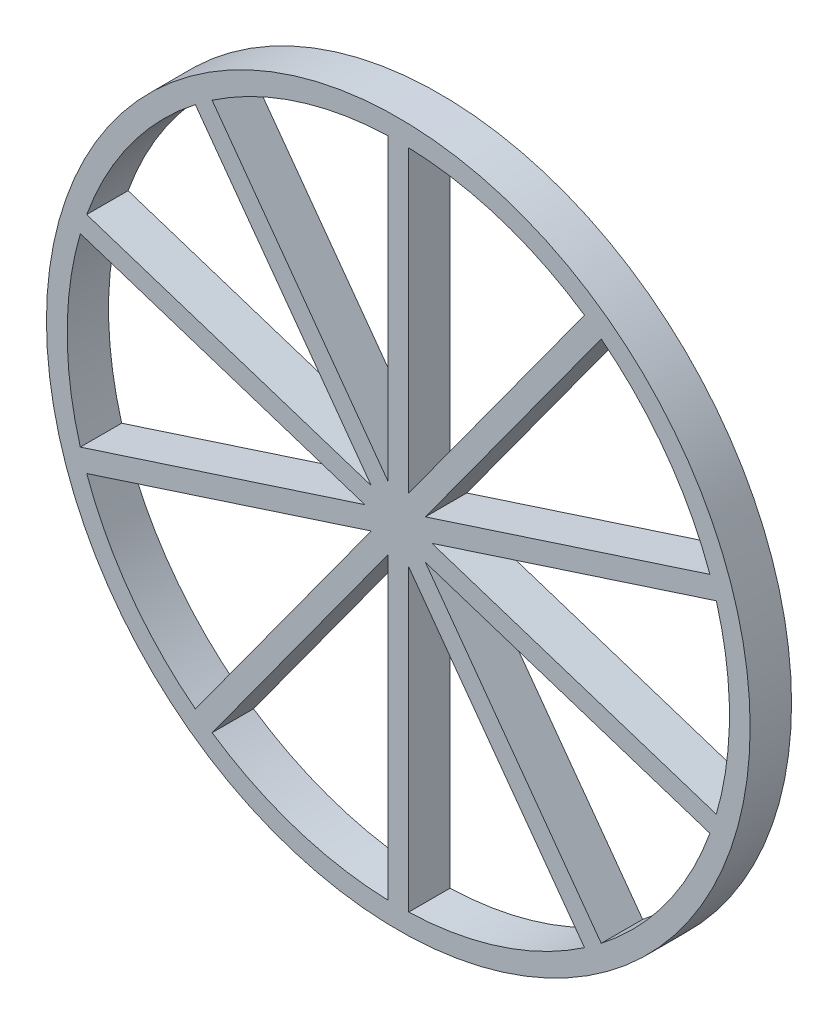
ISO-10303-21;
HEADER;
FILE_DESCRIPTION(('STEP AP214'),'2;1');
FILE_NAME('part.step','',(''),(''),'','','');
FILE_SCHEMA(('AUTOMOTIVE_DESIGN { 1 0 10303 214 1 1 1 1 }'));
ENDSEC;
DATA;
#1=APPLICATION_CONTEXT('core data for automotive mechanical design processes');
#2=APPLICATION_PROTOCOL_DEFINITION('international standard','automotive_design',2000,#1);
#3=PRODUCT_CONTEXT('',#1,'mechanical');
#4=PRODUCT('Part','Part','',(#3));
#5=PRODUCT_RELATED_PRODUCT_CATEGORY('part','',(#4));
#6=PRODUCT_DEFINITION_FORMATION('','',#4);
#7=PRODUCT_DEFINITION_CONTEXT('part definition',#1,'design');
#8=PRODUCT_DEFINITION('design','',#6,#7);
#9=PRODUCT_DEFINITION_SHAPE('','',#8);
#10=(LENGTH_UNIT() NAMED_UNIT(*) SI_UNIT(.MILLI.,.METRE.));
#11=(NAMED_UNIT(*) PLANE_ANGLE_UNIT() SI_UNIT($,.RADIAN.));
#12=(NAMED_UNIT(*) SI_UNIT($,.STERADIAN.) SOLID_ANGLE_UNIT());
#13=UNCERTAINTY_MEASURE_WITH_UNIT(LENGTH_MEASURE(1.E-05),#10,'distance_accuracy_value','');
#14=(GEOMETRIC_REPRESENTATION_CONTEXT(3) GLOBAL_UNCERTAINTY_ASSIGNED_CONTEXT((#13)) GLOBAL_UNIT_ASSIGNED_CONTEXT((#10,
#11,#12)) REPRESENTATION_CONTEXT('',''));
#15=CARTESIAN_POINT('',(0.,0.,0.));
#16=DIRECTION('',(0.,0.,1.));
#17=DIRECTION('',(1.,0.,0.));
#18=AXIS2_PLACEMENT_3D('',#15,#16,#17);
#19=CARTESIAN_POINT('',(0.,0.,1.));
#20=DIRECTION('',(0.,0.,1.));
#21=DIRECTION('',(1.,0.,0.));
#22=AXIS2_PLACEMENT_3D('',#19,#20,#21);
#23=PLANE('',#22);
#24=CARTESIAN_POINT('',(0.,0.,1.));
#25=DIRECTION('',(0.,0.,1.));
#26=DIRECTION('',(1.,0.,0.));
#27=AXIS2_PLACEMENT_3D('',#24,#25,#26);
#28=CIRCLE('',#27,8.5);
#29=CARTESIAN_POINT('',(8.5,0.,1.));
#30=VERTEX_POINT('',#29);
#31=EDGE_CURVE('E11',#30,#30,#28,.T.);
#32=ORIENTED_EDGE('',*,*,#31,.T.);
#33=EDGE_LOOP('',(#32));
#34=FACE_BOUND('',#33,.T.);
#35=DIRECTION('',(0.,-1.,0.));
#36=VECTOR('',#35,1.);
#37=CARTESIAN_POINT('',(0.25,0.769420884293812,1.));
#38=LINE('',#37,#36);
#39=CARTESIAN_POINT('',(0.25,7.99609279585974,1.));
#40=VERTEX_POINT('',#39);
#41=CARTESIAN_POINT('',(0.25,0.769420884293812,1.));
#42=VERTEX_POINT('',#41);
#43=EDGE_CURVE('E451',#40,#42,#38,.T.);
#44=ORIENTED_EDGE('',*,*,#43,.F.);
#45=CARTESIAN_POINT('',(0.,0.,1.));
#46=DIRECTION('',(0.,0.,1.));
#47=DIRECTION('',(1.,0.,0.));
#48=AXIS2_PLACEMENT_3D('',#45,#46,#47);
#49=CIRCLE('',#48,8.);
#50=CARTESIAN_POINT('',(4.49773117277472,6.61592127352273,1.));
#51=VERTEX_POINT('',#50);
#52=EDGE_CURVE('E449',#51,#40,#49,.T.);
#53=ORIENTED_EDGE('',*,*,#52,.F.);
#54=DIRECTION('',(0.587785252292474,0.809016994374947,0.));
#55=VECTOR('',#54,1.);
#56=CARTESIAN_POINT('',(0.25,0.769420884293812,1.));
#57=LINE('',#56,#55);
#58=EDGE_CURVE('E455',#42,#51,#57,.T.);
#59=ORIENTED_EDGE('',*,*,#58,.F.);
#60=EDGE_LOOP('',(#44,#53,#59));
#61=FACE_BOUND('',#60,.T.);
#62=DIRECTION('',(0.587785252292462,-0.809016994374955,0.));
#63=VECTOR('',#62,1.);
#64=CARTESIAN_POINT('',(-0.25,0.769420884293831,1.));
#65=LINE('',#64,#63);
#66=CARTESIAN_POINT('',(-4.49773117277462,6.61592127352279,1.));
#67=VERTEX_POINT('',#66);
#68=CARTESIAN_POINT('',(-0.25,0.769420884293831,1.));
#69=VERTEX_POINT('',#68);
#70=EDGE_CURVE('E427',#67,#69,#65,.T.);
#71=ORIENTED_EDGE('',*,*,#70,.F.);
#72=CARTESIAN_POINT('',(0.,0.,1.));
#73=DIRECTION('',(0.,0.,1.));
#74=DIRECTION('',(1.,0.,0.));
#75=AXIS2_PLACEMENT_3D('',#72,#73,#74);
#76=CIRCLE('',#75,8.);
#77=CARTESIAN_POINT('',(-0.25,7.99609279585974,1.));
#78=VERTEX_POINT('',#77);
#79=EDGE_CURVE('E425',#78,#67,#76,.T.);
#80=ORIENTED_EDGE('',*,*,#79,.F.);
#81=DIRECTION('',(0.,1.,0.));
#82=VECTOR('',#81,1.);
#83=CARTESIAN_POINT('',(-0.25,0.769420884293831,1.));
#84=LINE('',#83,#82);
#85=EDGE_CURVE('E431',#69,#78,#84,.T.);
#86=ORIENTED_EDGE('',*,*,#85,.F.);
#87=EDGE_LOOP('',(#71,#80,#86));
#88=FACE_BOUND('',#87,.T.);
#89=DIRECTION('',(0.,-1.,0.));
#90=VECTOR('',#89,1.);
#91=CARTESIAN_POINT('',(0.249999999999995,-0.769420884293813,1.));
#92=LINE('',#91,#90);
#93=CARTESIAN_POINT('',(0.249999999999995,-0.769420884293813,1.));
#94=VERTEX_POINT('',#93);
#95=CARTESIAN_POINT('',(0.249999999999944,-7.99609279585974,1.));
#96=VERTEX_POINT('',#95);
#97=EDGE_CURVE('E403',#94,#96,#92,.T.);
#98=ORIENTED_EDGE('',*,*,#97,.F.);
#99=DIRECTION('',(-0.587785252292468,0.809016994374951,0.));
#100=VECTOR('',#99,1.);
#101=CARTESIAN_POINT('',(0.249999999999995,-0.769420884293813,1.));
#102=LINE('',#101,#100);
#103=CARTESIAN_POINT('',(4.49773117277467,-6.61592127352276,1.));
#104=VERTEX_POINT('',#103);
#105=EDGE_CURVE('E401',#104,#94,#102,.T.);
#106=ORIENTED_EDGE('',*,*,#105,.F.);
#107=CARTESIAN_POINT('',(0.,0.,1.));
#108=DIRECTION('',(0.,0.,1.));
#109=DIRECTION('',(1.,0.,0.));
#110=AXIS2_PLACEMENT_3D('',#107,#108,#109);
#111=CIRCLE('',#110,8.);
#112=EDGE_CURVE('E407',#96,#104,#111,.T.);
#113=ORIENTED_EDGE('',*,*,#112,.F.);
#114=EDGE_LOOP('',(#98,#106,#113));
#115=FACE_BOUND('',#114,.T.);
#116=DIRECTION('',(-0.587785252292462,0.809016994374955,0.));
#117=VECTOR('',#116,1.);
#118=CARTESIAN_POINT('',(-0.654508497187466,0.475528258147583,1.));
#119=LINE('',#118,#117);
#120=CARTESIAN_POINT('',(-0.654508497187466,0.475528258147583,1.));
#121=VERTEX_POINT('',#120);
#122=CARTESIAN_POINT('',(-4.9022396699621,6.32202864737656,1.));
#123=VERTEX_POINT('',#122);
#124=EDGE_CURVE('E379',#121,#123,#119,.T.);
#125=ORIENTED_EDGE('',*,*,#124,.F.);
#126=DIRECTION('',(0.95105651629515,-0.309016994374958,0.));
#127=VECTOR('',#126,1.);
#128=CARTESIAN_POINT('',(-0.654508497187466,0.475528258147583,1.));
#129=LINE('',#128,#127);
#130=CARTESIAN_POINT('',(-7.52748190980937,2.70869269159362,1.));
#131=VERTEX_POINT('',#130);
#132=EDGE_CURVE('E377',#131,#121,#129,.T.);
#133=ORIENTED_EDGE('',*,*,#132,.F.);
#134=CARTESIAN_POINT('',(0.,0.,1.));
#135=DIRECTION('',(0.,0.,1.));
#136=DIRECTION('',(1.,0.,0.));
#137=AXIS2_PLACEMENT_3D('',#134,#135,#136);
#138=CIRCLE('',#137,8.);
#139=EDGE_CURVE('E383',#123,#131,#138,.T.);
#140=ORIENTED_EDGE('',*,*,#139,.F.);
#141=EDGE_LOOP('',(#125,#133,#140));
#142=FACE_BOUND('',#141,.T.);
#143=DIRECTION('',(-0.587785252292474,-0.809016994374947,0.));
#144=VECTOR('',#143,1.);
#145=CARTESIAN_POINT('',(0.654508497187473,0.475528258147574,1.));
#146=LINE('',#145,#144);
#147=CARTESIAN_POINT('',(4.90223966996219,6.32202864737649,1.));
#148=VERTEX_POINT('',#147);
#149=CARTESIAN_POINT('',(0.654508497187473,0.475528258147574,1.));
#150=VERTEX_POINT('',#149);
#151=EDGE_CURVE('E355',#148,#150,#146,.T.);
#152=ORIENTED_EDGE('',*,*,#151,.F.);
#153=CARTESIAN_POINT('',(0.,0.,1.));
#154=DIRECTION('',(0.,0.,1.));
#155=DIRECTION('',(1.,0.,0.));
#156=AXIS2_PLACEMENT_3D('',#153,#154,#155);
#157=CIRCLE('',#156,8.);
#158=CARTESIAN_POINT('',(7.52748190980941,2.70869269159351,1.));
#159=VERTEX_POINT('',#158);
#160=EDGE_CURVE('E353',#159,#148,#157,.T.);
#161=ORIENTED_EDGE('',*,*,#160,.F.);
#162=DIRECTION('',(0.951056516295154,0.309016994374945,0.));
#163=VECTOR('',#162,1.);
#164=CARTESIAN_POINT('',(0.654508497187473,0.475528258147574,1.));
#165=LINE('',#164,#163);
#166=EDGE_CURVE('E359',#150,#159,#165,.T.);
#167=ORIENTED_EDGE('',*,*,#166,.F.);
#168=EDGE_LOOP('',(#152,#161,#167));
#169=FACE_BOUND('',#168,.T.);
#170=DIRECTION('',(-0.951056516295154,-0.309016994374945,0.));
#171=VECTOR('',#170,1.);
#172=CARTESIAN_POINT('',(0.809016994374946,0.,1.));
#173=LINE('',#172,#171);
#174=CARTESIAN_POINT('',(7.68199040699688,2.23316443344594,1.));
#175=VERTEX_POINT('',#174);
#176=CARTESIAN_POINT('',(0.809016994374946,0.,1.));
#177=VERTEX_POINT('',#176);
#178=EDGE_CURVE('E331',#175,#177,#173,.T.);
#179=ORIENTED_EDGE('',*,*,#178,.F.);
#180=CARTESIAN_POINT('',(0.,0.,1.));
#181=DIRECTION('',(0.,0.,1.));
#182=DIRECTION('',(1.,0.,0.));
#183=AXIS2_PLACEMENT_3D('',#180,#181,#182);
#184=CIRCLE('',#183,8.);
#185=CARTESIAN_POINT('',(7.68199040699687,-2.23316443344599,1.));
#186=VERTEX_POINT('',#185);
#187=EDGE_CURVE('E329',#186,#175,#184,.T.);
#188=ORIENTED_EDGE('',*,*,#187,.F.);
#189=DIRECTION('',(0.951056516295152,-0.309016994374952,0.));
#190=VECTOR('',#189,1.);
#191=CARTESIAN_POINT('',(0.809016994374946,0.,1.));
#192=LINE('',#191,#190);
#193=EDGE_CURVE('E335',#177,#186,#192,.T.);
#194=ORIENTED_EDGE('',*,*,#193,.F.);
#195=EDGE_LOOP('',(#179,#188,#194));
#196=FACE_BOUND('',#195,.T.);
#197=DIRECTION('',(-0.951056516295152,0.309016994374952,0.));
#198=VECTOR('',#197,1.);
#199=CARTESIAN_POINT('',(0.65450849718747,-0.475528258147579,1.));
#200=LINE('',#199,#198);
#201=CARTESIAN_POINT('',(7.52748190980939,-2.70869269159357,1.));
#202=VERTEX_POINT('',#201);
#203=CARTESIAN_POINT('',(0.65450849718747,-0.475528258147579,1.));
#204=VERTEX_POINT('',#203);
#205=EDGE_CURVE('E307',#202,#204,#200,.T.);
#206=ORIENTED_EDGE('',*,*,#205,.F.);
#207=CARTESIAN_POINT('',(0.,0.,1.));
#208=DIRECTION('',(0.,0.,1.));
#209=DIRECTION('',(1.,0.,0.));
#210=AXIS2_PLACEMENT_3D('',#207,#208,#209);
#211=CIRCLE('',#210,8.);
#212=CARTESIAN_POINT('',(4.90223966996214,-6.32202864737652,1.));
#213=VERTEX_POINT('',#212);
#214=EDGE_CURVE('E305',#213,#202,#211,.T.);
#215=ORIENTED_EDGE('',*,*,#214,.F.);
#216=DIRECTION('',(0.587785252292468,-0.809016994374951,0.));
#217=VECTOR('',#216,1.);
#218=CARTESIAN_POINT('',(0.65450849718747,-0.475528258147579,1.));
#219=LINE('',#218,#217);
#220=EDGE_CURVE('E311',#204,#213,#219,.T.);
#221=ORIENTED_EDGE('',*,*,#220,.F.);
#222=EDGE_LOOP('',(#206,#215,#221));
#223=FACE_BOUND('',#222,.T.);
#224=DIRECTION('',(0.,1.,0.));
#225=VECTOR('',#224,1.);
#226=CARTESIAN_POINT('',(-0.250000000000005,-0.769420884293809,1.));
#227=LINE('',#226,#225);
#228=CARTESIAN_POINT('',(-0.250000000000056,-7.99609279585974,1.));
#229=VERTEX_POINT('',#228);
#230=CARTESIAN_POINT('',(-0.250000000000005,-0.769420884293809,1.));
#231=VERTEX_POINT('',#230);
#232=EDGE_CURVE('E283',#229,#231,#227,.T.);
#233=ORIENTED_EDGE('',*,*,#232,.F.);
#234=CARTESIAN_POINT('',(0.,0.,1.));
#235=DIRECTION('',(0.,0.,1.));
#236=DIRECTION('',(1.,0.,0.));
#237=AXIS2_PLACEMENT_3D('',#234,#235,#236);
#238=CIRCLE('',#237,8.);
#239=CARTESIAN_POINT('',(-4.49773117277476,-6.61592127352269,1.));
#240=VERTEX_POINT('',#239);
#241=EDGE_CURVE('E281',#240,#229,#238,.T.);
#242=ORIENTED_EDGE('',*,*,#241,.F.);
#243=DIRECTION('',(-0.58778525229248,-0.809016994374942,0.));
#244=VECTOR('',#243,1.);
#245=CARTESIAN_POINT('',(-0.250000000000005,-0.769420884293809,1.));
#246=LINE('',#245,#244);
#247=EDGE_CURVE('E287',#231,#240,#246,.T.);
#248=ORIENTED_EDGE('',*,*,#247,.F.);
#249=EDGE_LOOP('',(#233,#242,#248));
#250=FACE_BOUND('',#249,.T.);
#251=DIRECTION('',(0.58778525229248,0.809016994374942,0.));
#252=VECTOR('',#251,1.);
#253=CARTESIAN_POINT('',(-0.654508497187477,-0.47552825814757,1.));
#254=LINE('',#253,#252);
#255=CARTESIAN_POINT('',(-4.90223966996223,-6.32202864737645,1.));
#256=VERTEX_POINT('',#255);
#257=CARTESIAN_POINT('',(-0.654508497187477,-0.47552825814757,1.));
#258=VERTEX_POINT('',#257);
#259=EDGE_CURVE('E259',#256,#258,#254,.T.);
#260=ORIENTED_EDGE('',*,*,#259,.F.);
#261=CARTESIAN_POINT('',(0.,0.,1.));
#262=DIRECTION('',(0.,0.,1.));
#263=DIRECTION('',(1.,0.,0.));
#264=AXIS2_PLACEMENT_3D('',#261,#262,#263);
#265=CIRCLE('',#264,8.);
#266=CARTESIAN_POINT('',(-7.52748190980943,-2.70869269159346,1.));
#267=VERTEX_POINT('',#266);
#268=EDGE_CURVE('E257',#267,#256,#265,.T.);
#269=ORIENTED_EDGE('',*,*,#268,.F.);
#270=DIRECTION('',(-0.951056516295157,-0.309016994374938,0.));
#271=VECTOR('',#270,1.);
#272=CARTESIAN_POINT('',(-0.654508497187477,-0.47552825814757,1.));
#273=LINE('',#272,#271);
#274=EDGE_CURVE('E263',#258,#267,#273,.T.);
#275=ORIENTED_EDGE('',*,*,#274,.F.);
#276=EDGE_LOOP('',(#260,#269,#275));
#277=FACE_BOUND('',#276,.T.);
#278=DIRECTION('',(0.951056516295156,0.309016994374938,0.));
#279=VECTOR('',#278,1.);
#280=CARTESIAN_POINT('',(-0.809016994374945,0.,1.));
#281=LINE('',#280,#279);
#282=CARTESIAN_POINT('',(-7.68199040699689,-2.23316443344588,1.));
#283=VERTEX_POINT('',#282);
#284=CARTESIAN_POINT('',(-0.809016994374945,0.,1.));
#285=VERTEX_POINT('',#284);
#286=EDGE_CURVE('E238',#283,#285,#281,.T.);
#287=ORIENTED_EDGE('',*,*,#286,.F.);
#288=CARTESIAN_POINT('',(0.,0.,1.));
#289=DIRECTION('',(0.,0.,1.));
#290=DIRECTION('',(1.,0.,0.));
#291=AXIS2_PLACEMENT_3D('',#288,#289,#290);
#292=CIRCLE('',#291,8.);
#293=CARTESIAN_POINT('',(-7.68199040699685,2.23316443344604,1.));
#294=VERTEX_POINT('',#293);
#295=EDGE_CURVE('E230',#294,#283,#292,.T.);
#296=ORIENTED_EDGE('',*,*,#295,.F.);
#297=DIRECTION('',(-0.95105651629515,0.309016994374958,0.));
#298=VECTOR('',#297,1.);
#299=CARTESIAN_POINT('',(-0.809016994374945,0.,1.));
#300=LINE('',#299,#298);
#301=EDGE_CURVE('E247',#285,#294,#300,.T.);
#302=ORIENTED_EDGE('',*,*,#301,.F.);
#303=EDGE_LOOP('',(#287,#296,#302));
#304=FACE_BOUND('',#303,.T.);
#305=ADVANCED_FACE('F33',(#34,#61,#88,#115,#142,#169,#196,#223,#250,#277,#304),#23,.T.);
#306=CARTESIAN_POINT('',(0.,0.,0.));
#307=DIRECTION('',(0.,0.,1.));
#308=DIRECTION('',(1.,0.,0.));
#309=AXIS2_PLACEMENT_3D('',#306,#307,#308);
#310=PLANE('',#309);
#311=CARTESIAN_POINT('',(0.,0.,0.));
#312=DIRECTION('',(0.,0.,1.));
#313=DIRECTION('',(1.,0.,0.));
#314=AXIS2_PLACEMENT_3D('',#311,#312,#313);
#315=CIRCLE('',#314,8.);
#316=CARTESIAN_POINT('',(-7.52748190980943,-2.70869269159346,0.));
#317=VERTEX_POINT('',#316);
#318=CARTESIAN_POINT('',(-4.90223966996223,-6.32202864737645,0.));
#319=VERTEX_POINT('',#318);
#320=EDGE_CURVE('E245',#317,#319,#315,.T.);
#321=ORIENTED_EDGE('',*,*,#320,.T.);
#322=DIRECTION('',(0.58778525229248,0.809016994374942,0.));
#323=VECTOR('',#322,1.);
#324=CARTESIAN_POINT('',(-0.654508497187477,-0.47552825814757,0.));
#325=LINE('',#324,#323);
#326=CARTESIAN_POINT('',(-0.654508497187477,-0.47552825814757,0.));
#327=VERTEX_POINT('',#326);
#328=EDGE_CURVE('E268',#319,#327,#325,.T.);
#329=ORIENTED_EDGE('',*,*,#328,.T.);
#330=DIRECTION('',(-0.951056516295157,-0.309016994374938,0.));
#331=VECTOR('',#330,1.);
#332=CARTESIAN_POINT('',(-0.654508497187477,-0.47552825814757,0.));
#333=LINE('',#332,#331);
#334=EDGE_CURVE('E260',#327,#317,#333,.T.);
#335=ORIENTED_EDGE('',*,*,#334,.T.);
#336=EDGE_LOOP('',(#321,#329,#335));
#337=FACE_BOUND('',#336,.T.);
#338=CARTESIAN_POINT('',(0.,0.,0.));
#339=DIRECTION('',(0.,0.,1.));
#340=DIRECTION('',(1.,0.,0.));
#341=AXIS2_PLACEMENT_3D('',#338,#339,#340);
#342=CIRCLE('',#341,8.);
#343=CARTESIAN_POINT('',(4.90223966996214,-6.32202864737652,0.));
#344=VERTEX_POINT('',#343);
#345=CARTESIAN_POINT('',(7.52748190980939,-2.70869269159357,0.));
#346=VERTEX_POINT('',#345);
#347=EDGE_CURVE('E304',#344,#346,#342,.T.);
#348=ORIENTED_EDGE('',*,*,#347,.T.);
#349=DIRECTION('',(-0.951056516295152,0.309016994374952,0.));
#350=VECTOR('',#349,1.);
#351=CARTESIAN_POINT('',(0.65450849718747,-0.475528258147579,0.));
#352=LINE('',#351,#350);
#353=CARTESIAN_POINT('',(0.65450849718747,-0.475528258147579,0.));
#354=VERTEX_POINT('',#353);
#355=EDGE_CURVE('E316',#346,#354,#352,.T.);
#356=ORIENTED_EDGE('',*,*,#355,.T.);
#357=DIRECTION('',(0.587785252292468,-0.809016994374951,0.));
#358=VECTOR('',#357,1.);
#359=CARTESIAN_POINT('',(0.65450849718747,-0.475528258147579,0.));
#360=LINE('',#359,#358);
#361=EDGE_CURVE('E308',#354,#344,#360,.T.);
#362=ORIENTED_EDGE('',*,*,#361,.T.);
#363=EDGE_LOOP('',(#348,#356,#362));
#364=FACE_BOUND('',#363,.T.);
#365=CARTESIAN_POINT('',(0.,0.,0.));
#366=DIRECTION('',(0.,0.,1.));
#367=DIRECTION('',(1.,0.,0.));
#368=AXIS2_PLACEMENT_3D('',#365,#366,#367);
#369=CIRCLE('',#368,8.);
#370=CARTESIAN_POINT('',(7.52748190980941,2.70869269159351,0.));
#371=VERTEX_POINT('',#370);
#372=CARTESIAN_POINT('',(4.90223966996219,6.32202864737649,0.));
#373=VERTEX_POINT('',#372);
#374=EDGE_CURVE('E352',#371,#373,#369,.T.);
#375=ORIENTED_EDGE('',*,*,#374,.T.);
#376=DIRECTION('',(-0.587785252292474,-0.809016994374947,0.));
#377=VECTOR('',#376,1.);
#378=CARTESIAN_POINT('',(0.654508497187473,0.475528258147574,0.));
#379=LINE('',#378,#377);
#380=CARTESIAN_POINT('',(0.654508497187473,0.475528258147574,0.));
#381=VERTEX_POINT('',#380);
#382=EDGE_CURVE('E364',#373,#381,#379,.T.);
#383=ORIENTED_EDGE('',*,*,#382,.T.);
#384=DIRECTION('',(0.951056516295154,0.309016994374945,0.));
#385=VECTOR('',#384,1.);
#386=CARTESIAN_POINT('',(0.654508497187473,0.475528258147574,0.));
#387=LINE('',#386,#385);
#388=EDGE_CURVE('E356',#381,#371,#387,.T.);
#389=ORIENTED_EDGE('',*,*,#388,.T.);
#390=EDGE_LOOP('',(#375,#383,#389));
#391=FACE_BOUND('',#390,.T.);
#392=DIRECTION('',(-0.587785252292468,0.809016994374951,0.));
#393=VECTOR('',#392,1.);
#394=CARTESIAN_POINT('',(0.249999999999995,-0.769420884293813,0.));
#395=LINE('',#394,#393);
#396=CARTESIAN_POINT('',(4.49773117277467,-6.61592127352276,0.));
#397=VERTEX_POINT('',#396);
#398=CARTESIAN_POINT('',(0.249999999999995,-0.769420884293813,0.));
#399=VERTEX_POINT('',#398);
#400=EDGE_CURVE('E400',#397,#399,#395,.T.);
#401=ORIENTED_EDGE('',*,*,#400,.T.);
#402=DIRECTION('',(0.,-1.,0.));
#403=VECTOR('',#402,1.);
#404=CARTESIAN_POINT('',(0.249999999999995,-0.769420884293813,0.));
#405=LINE('',#404,#403);
#406=CARTESIAN_POINT('',(0.249999999999944,-7.99609279585974,0.));
#407=VERTEX_POINT('',#406);
#408=EDGE_CURVE('E412',#399,#407,#405,.T.);
#409=ORIENTED_EDGE('',*,*,#408,.T.);
#410=CARTESIAN_POINT('',(0.,0.,0.));
#411=DIRECTION('',(0.,0.,1.));
#412=DIRECTION('',(1.,0.,0.));
#413=AXIS2_PLACEMENT_3D('',#410,#411,#412);
#414=CIRCLE('',#413,8.);
#415=EDGE_CURVE('E404',#407,#397,#414,.T.);
#416=ORIENTED_EDGE('',*,*,#415,.T.);
#417=EDGE_LOOP('',(#401,#409,#416));
#418=FACE_BOUND('',#417,.T.);
#419=CARTESIAN_POINT('',(0.,0.,0.));
#420=DIRECTION('',(0.,0.,1.));
#421=DIRECTION('',(1.,0.,0.));
#422=AXIS2_PLACEMENT_3D('',#419,#420,#421);
#423=CIRCLE('',#422,8.);
#424=CARTESIAN_POINT('',(4.49773117277472,6.61592127352273,0.));
#425=VERTEX_POINT('',#424);
#426=CARTESIAN_POINT('',(0.25,7.99609279585974,0.));
#427=VERTEX_POINT('',#426);
#428=EDGE_CURVE('E448',#425,#427,#423,.T.);
#429=ORIENTED_EDGE('',*,*,#428,.T.);
#430=DIRECTION('',(0.,-1.,0.));
#431=VECTOR('',#430,1.);
#432=CARTESIAN_POINT('',(0.25,0.769420884293812,0.));
#433=LINE('',#432,#431);
#434=CARTESIAN_POINT('',(0.25,0.769420884293812,0.));
#435=VERTEX_POINT('',#434);
#436=EDGE_CURVE('E460',#427,#435,#433,.T.);
#437=ORIENTED_EDGE('',*,*,#436,.T.);
#438=DIRECTION('',(0.587785252292474,0.809016994374947,0.));
#439=VECTOR('',#438,1.);
#440=CARTESIAN_POINT('',(0.25,0.769420884293812,0.));
#441=LINE('',#440,#439);
#442=EDGE_CURVE('E452',#435,#425,#441,.T.);
#443=ORIENTED_EDGE('',*,*,#442,.T.);
#444=EDGE_LOOP('',(#429,#437,#443));
#445=FACE_BOUND('',#444,.T.);
#446=CARTESIAN_POINT('',(0.,0.,0.));
#447=DIRECTION('',(0.,0.,1.));
#448=DIRECTION('',(1.,0.,0.));
#449=AXIS2_PLACEMENT_3D('',#446,#447,#448);
#450=CIRCLE('',#449,8.5);
#451=CARTESIAN_POINT('',(8.5,0.,0.));
#452=VERTEX_POINT('',#451);
#453=EDGE_CURVE('E37',#452,#452,#450,.T.);
#454=ORIENTED_EDGE('',*,*,#453,.F.);
#455=EDGE_LOOP('',(#454));
#456=FACE_BOUND('',#455,.T.);
#457=CARTESIAN_POINT('',(0.,0.,0.));
#458=DIRECTION('',(0.,0.,1.));
#459=DIRECTION('',(1.,0.,0.));
#460=AXIS2_PLACEMENT_3D('',#457,#458,#459);
#461=CIRCLE('',#460,8.);
#462=CARTESIAN_POINT('',(-0.25,7.99609279585974,0.));
#463=VERTEX_POINT('',#462);
#464=CARTESIAN_POINT('',(-4.49773117277462,6.61592127352279,0.));
#465=VERTEX_POINT('',#464);
#466=EDGE_CURVE('E424',#463,#465,#461,.T.);
#467=ORIENTED_EDGE('',*,*,#466,.T.);
#468=DIRECTION('',(0.587785252292462,-0.809016994374955,0.));
#469=VECTOR('',#468,1.);
#470=CARTESIAN_POINT('',(-0.25,0.769420884293831,0.));
#471=LINE('',#470,#469);
#472=CARTESIAN_POINT('',(-0.25,0.769420884293831,0.));
#473=VERTEX_POINT('',#472);
#474=EDGE_CURVE('E436',#465,#473,#471,.T.);
#475=ORIENTED_EDGE('',*,*,#474,.T.);
#476=DIRECTION('',(0.,1.,0.));
#477=VECTOR('',#476,1.);
#478=CARTESIAN_POINT('',(-0.25,0.769420884293831,0.));
#479=LINE('',#478,#477);
#480=EDGE_CURVE('E428',#473,#463,#479,.T.);
#481=ORIENTED_EDGE('',*,*,#480,.T.);
#482=EDGE_LOOP('',(#467,#475,#481));
#483=FACE_BOUND('',#482,.T.);
#484=DIRECTION('',(0.95105651629515,-0.309016994374958,0.));
#485=VECTOR('',#484,1.);
#486=CARTESIAN_POINT('',(-0.654508497187466,0.475528258147583,0.));
#487=LINE('',#486,#485);
#488=CARTESIAN_POINT('',(-7.52748190980937,2.70869269159362,0.));
#489=VERTEX_POINT('',#488);
#490=CARTESIAN_POINT('',(-0.654508497187466,0.475528258147583,0.));
#491=VERTEX_POINT('',#490);
#492=EDGE_CURVE('E376',#489,#491,#487,.T.);
#493=ORIENTED_EDGE('',*,*,#492,.T.);
#494=DIRECTION('',(-0.587785252292462,0.809016994374955,0.));
#495=VECTOR('',#494,1.);
#496=CARTESIAN_POINT('',(-0.654508497187466,0.475528258147583,0.));
#497=LINE('',#496,#495);
#498=CARTESIAN_POINT('',(-4.9022396699621,6.32202864737656,0.));
#499=VERTEX_POINT('',#498);
#500=EDGE_CURVE('E388',#491,#499,#497,.T.);
#501=ORIENTED_EDGE('',*,*,#500,.T.);
#502=CARTESIAN_POINT('',(0.,0.,0.));
#503=DIRECTION('',(0.,0.,1.));
#504=DIRECTION('',(1.,0.,0.));
#505=AXIS2_PLACEMENT_3D('',#502,#503,#504);
#506=CIRCLE('',#505,8.);
#507=EDGE_CURVE('E380',#499,#489,#506,.T.);
#508=ORIENTED_EDGE('',*,*,#507,.T.);
#509=EDGE_LOOP('',(#493,#501,#508));
#510=FACE_BOUND('',#509,.T.);
#511=CARTESIAN_POINT('',(0.,0.,0.));
#512=DIRECTION('',(0.,0.,1.));
#513=DIRECTION('',(1.,0.,0.));
#514=AXIS2_PLACEMENT_3D('',#511,#512,#513);
#515=CIRCLE('',#514,8.);
#516=CARTESIAN_POINT('',(7.68199040699687,-2.23316443344599,0.));
#517=VERTEX_POINT('',#516);
#518=CARTESIAN_POINT('',(7.68199040699688,2.23316443344594,0.));
#519=VERTEX_POINT('',#518);
#520=EDGE_CURVE('E328',#517,#519,#515,.T.);
#521=ORIENTED_EDGE('',*,*,#520,.T.);
#522=DIRECTION('',(-0.951056516295154,-0.309016994374945,0.));
#523=VECTOR('',#522,1.);
#524=CARTESIAN_POINT('',(0.809016994374946,0.,0.));
#525=LINE('',#524,#523);
#526=CARTESIAN_POINT('',(0.809016994374946,0.,0.));
#527=VERTEX_POINT('',#526);
#528=EDGE_CURVE('E340',#519,#527,#525,.T.);
#529=ORIENTED_EDGE('',*,*,#528,.T.);
#530=DIRECTION('',(0.951056516295152,-0.309016994374952,0.));
#531=VECTOR('',#530,1.);
#532=CARTESIAN_POINT('',(0.809016994374946,0.,0.));
#533=LINE('',#532,#531);
#534=EDGE_CURVE('E332',#527,#517,#533,.T.);
#535=ORIENTED_EDGE('',*,*,#534,.T.);
#536=EDGE_LOOP('',(#521,#529,#535));
#537=FACE_BOUND('',#536,.T.);
#538=CARTESIAN_POINT('',(0.,0.,0.));
#539=DIRECTION('',(0.,0.,1.));
#540=DIRECTION('',(1.,0.,0.));
#541=AXIS2_PLACEMENT_3D('',#538,#539,#540);
#542=CIRCLE('',#541,8.);
#543=CARTESIAN_POINT('',(-4.49773117277476,-6.61592127352269,0.));
#544=VERTEX_POINT('',#543);
#545=CARTESIAN_POINT('',(-0.250000000000056,-7.99609279585974,0.));
#546=VERTEX_POINT('',#545);
#547=EDGE_CURVE('E280',#544,#546,#542,.T.);
#548=ORIENTED_EDGE('',*,*,#547,.T.);
#549=DIRECTION('',(0.,1.,0.));
#550=VECTOR('',#549,1.);
#551=CARTESIAN_POINT('',(-0.250000000000005,-0.769420884293809,0.));
#552=LINE('',#551,#550);
#553=CARTESIAN_POINT('',(-0.250000000000005,-0.769420884293809,0.));
#554=VERTEX_POINT('',#553);
#555=EDGE_CURVE('E292',#546,#554,#552,.T.);
#556=ORIENTED_EDGE('',*,*,#555,.T.);
#557=DIRECTION('',(-0.58778525229248,-0.809016994374942,0.));
#558=VECTOR('',#557,1.);
#559=CARTESIAN_POINT('',(-0.250000000000005,-0.769420884293809,0.));
#560=LINE('',#559,#558);
#561=EDGE_CURVE('E284',#554,#544,#560,.T.);
#562=ORIENTED_EDGE('',*,*,#561,.T.);
#563=EDGE_LOOP('',(#548,#556,#562));
#564=FACE_BOUND('',#563,.T.);
#565=CARTESIAN_POINT('',(0.,0.,0.));
#566=DIRECTION('',(0.,0.,1.));
#567=DIRECTION('',(1.,0.,0.));
#568=AXIS2_PLACEMENT_3D('',#565,#566,#567);
#569=CIRCLE('',#568,8.);
#570=CARTESIAN_POINT('',(-7.68199040699685,2.23316443344604,0.));
#571=VERTEX_POINT('',#570);
#572=CARTESIAN_POINT('',(-7.68199040699689,-2.23316443344588,0.));
#573=VERTEX_POINT('',#572);
#574=EDGE_CURVE('E56',#571,#573,#569,.T.);
#575=ORIENTED_EDGE('',*,*,#574,.T.);
#576=DIRECTION('',(0.951056516295156,0.309016994374938,0.));
#577=VECTOR('',#576,1.);
#578=CARTESIAN_POINT('',(-0.809016994374945,0.,0.));
#579=LINE('',#578,#577);
#580=CARTESIAN_POINT('',(-0.809016994374945,0.,0.));
#581=VERTEX_POINT('',#580);
#582=EDGE_CURVE('E244',#573,#581,#579,.T.);
#583=ORIENTED_EDGE('',*,*,#582,.T.);
#584=DIRECTION('',(-0.95105651629515,0.309016994374958,0.));
#585=VECTOR('',#584,1.);
#586=CARTESIAN_POINT('',(-0.809016994374945,0.,0.));
#587=LINE('',#586,#585);
#588=EDGE_CURVE('E239',#581,#571,#587,.T.);
#589=ORIENTED_EDGE('',*,*,#588,.T.);
#590=EDGE_LOOP('',(#575,#583,#589));
#591=FACE_BOUND('',#590,.T.);
#592=ADVANCED_FACE('F477',(#337,#364,#391,#418,#445,#456,#483,#510,#537,#564,#591),#310,.F.);
#593=CARTESIAN_POINT('',(0.,0.,1.));
#594=DIRECTION('',(0.,0.,-1.));
#595=DIRECTION('',(-1.,0.,0.));
#596=AXIS2_PLACEMENT_3D('',#593,#594,#595);
#597=CYLINDRICAL_SURFACE('',#596,8.5);
#598=ORIENTED_EDGE('',*,*,#31,.F.);
#599=EDGE_LOOP('',(#598));
#600=FACE_BOUND('',#599,.T.);
#601=ORIENTED_EDGE('',*,*,#453,.T.);
#602=EDGE_LOOP('',(#601));
#603=FACE_BOUND('',#602,.T.);
#604=ADVANCED_FACE('F35',(#600,#603),#597,.T.);
#605=CARTESIAN_POINT('',(0.,0.,1.));
#606=DIRECTION('',(0.,0.,-1.));
#607=DIRECTION('',(-1.,0.,0.));
#608=AXIS2_PLACEMENT_3D('',#605,#606,#607);
#609=CYLINDRICAL_SURFACE('',#608,8.);
#610=ORIENTED_EDGE('',*,*,#428,.F.);
#611=DIRECTION('',(0.,0.,-1.));
#612=VECTOR('',#611,1.);
#613=CARTESIAN_POINT('',(4.49773117277472,6.61592127352273,1.));
#614=LINE('',#613,#612);
#615=EDGE_CURVE('E457',#51,#425,#614,.T.);
#616=ORIENTED_EDGE('',*,*,#615,.F.);
#617=ORIENTED_EDGE('',*,*,#52,.T.);
#618=DIRECTION('',(0.,0.,-1.));
#619=VECTOR('',#618,1.);
#620=CARTESIAN_POINT('',(0.25,7.99609279585974,1.));
#621=LINE('',#620,#619);
#622=EDGE_CURVE('E469',#40,#427,#621,.T.);
#623=ORIENTED_EDGE('',*,*,#622,.T.);
#624=EDGE_LOOP('',(#610,#616,#617,#623));
#625=FACE_BOUND('',#624,.T.);
#626=ADVANCED_FACE('F499',(#625),#609,.F.);
#627=CARTESIAN_POINT('',(0.25,0.769420884293812,1.));
#628=DIRECTION('',(1.,0.,0.));
#629=DIRECTION('',(0.,0.,-1.));
#630=AXIS2_PLACEMENT_3D('',#627,#628,#629);
#631=PLANE('',#630);
#632=ORIENTED_EDGE('',*,*,#436,.F.);
#633=ORIENTED_EDGE('',*,*,#622,.F.);
#634=ORIENTED_EDGE('',*,*,#43,.T.);
#635=DIRECTION('',(0.,0.,-1.));
#636=VECTOR('',#635,1.);
#637=CARTESIAN_POINT('',(0.25,0.769420884293812,1.));
#638=LINE('',#637,#636);
#639=EDGE_CURVE('E467',#42,#435,#638,.T.);
#640=ORIENTED_EDGE('',*,*,#639,.T.);
#641=EDGE_LOOP('',(#632,#633,#634,#640));
#642=FACE_BOUND('',#641,.T.);
#643=ADVANCED_FACE('F502',(#642),#631,.T.);
#644=CARTESIAN_POINT('',(0.25,0.769420884293812,1.));
#645=DIRECTION('',(-0.809016994374947,0.587785252292474,0.));
#646=DIRECTION('',(-0.587785252292474,-0.809016994374947,0.));
#647=AXIS2_PLACEMENT_3D('',#644,#645,#646);
#648=PLANE('',#647);
#649=ORIENTED_EDGE('',*,*,#442,.F.);
#650=ORIENTED_EDGE('',*,*,#639,.F.);
#651=ORIENTED_EDGE('',*,*,#58,.T.);
#652=ORIENTED_EDGE('',*,*,#615,.T.);
#653=EDGE_LOOP('',(#649,#650,#651,#652));
#654=FACE_BOUND('',#653,.T.);
#655=ADVANCED_FACE('F505',(#654),#648,.T.);
#656=CARTESIAN_POINT('',(0.,0.,1.));
#657=DIRECTION('',(0.,0.,-1.));
#658=DIRECTION('',(-1.,0.,0.));
#659=AXIS2_PLACEMENT_3D('',#656,#657,#658);
#660=CYLINDRICAL_SURFACE('',#659,8.);
#661=ORIENTED_EDGE('',*,*,#466,.F.);
#662=DIRECTION('',(0.,0.,-1.));
#663=VECTOR('',#662,1.);
#664=CARTESIAN_POINT('',(-0.25,7.99609279585974,1.));
#665=LINE('',#664,#663);
#666=EDGE_CURVE('E433',#78,#463,#665,.T.);
#667=ORIENTED_EDGE('',*,*,#666,.F.);
#668=ORIENTED_EDGE('',*,*,#79,.T.);
#669=DIRECTION('',(0.,0.,-1.));
#670=VECTOR('',#669,1.);
#671=CARTESIAN_POINT('',(-4.49773117277462,6.61592127352279,1.));
#672=LINE('',#671,#670);
#673=EDGE_CURVE('E445',#67,#465,#672,.T.);
#674=ORIENTED_EDGE('',*,*,#673,.T.);
#675=EDGE_LOOP('',(#661,#667,#668,#674));
#676=FACE_BOUND('',#675,.T.);
#677=ADVANCED_FACE('F509',(#676),#660,.F.);
#678=CARTESIAN_POINT('',(-0.25,0.769420884293831,1.));
#679=DIRECTION('',(0.809016994374955,0.587785252292462,0.));
#680=DIRECTION('',(-0.587785252292462,0.809016994374955,0.));
#681=AXIS2_PLACEMENT_3D('',#678,#679,#680);
#682=PLANE('',#681);
#683=ORIENTED_EDGE('',*,*,#474,.F.);
#684=ORIENTED_EDGE('',*,*,#673,.F.);
#685=ORIENTED_EDGE('',*,*,#70,.T.);
#686=DIRECTION('',(0.,0.,-1.));
#687=VECTOR('',#686,1.);
#688=CARTESIAN_POINT('',(-0.25,0.769420884293831,1.));
#689=LINE('',#688,#687);
#690=EDGE_CURVE('E443',#69,#473,#689,.T.);
#691=ORIENTED_EDGE('',*,*,#690,.T.);
#692=EDGE_LOOP('',(#683,#684,#685,#691));
#693=FACE_BOUND('',#692,.T.);
#694=ADVANCED_FACE('F513',(#693),#682,.T.);
#695=CARTESIAN_POINT('',(-0.25,0.769420884293831,1.));
#696=DIRECTION('',(-1.,0.,0.));
#697=DIRECTION('',(0.,-1.,0.));
#698=AXIS2_PLACEMENT_3D('',#695,#696,#697);
#699=PLANE('',#698);
#700=ORIENTED_EDGE('',*,*,#480,.F.);
#701=ORIENTED_EDGE('',*,*,#690,.F.);
#702=ORIENTED_EDGE('',*,*,#85,.T.);
#703=ORIENTED_EDGE('',*,*,#666,.T.);
#704=EDGE_LOOP('',(#700,#701,#702,#703));
#705=FACE_BOUND('',#704,.T.);
#706=ADVANCED_FACE('F517',(#705),#699,.T.);
#707=CARTESIAN_POINT('',(0.249999999999995,-0.769420884293813,1.));
#708=DIRECTION('',(-0.809016994374951,-0.587785252292469,0.));
#709=DIRECTION('',(0.587785252292469,-0.809016994374951,0.));
#710=AXIS2_PLACEMENT_3D('',#707,#708,#709);
#711=PLANE('',#710);
#712=ORIENTED_EDGE('',*,*,#400,.F.);
#713=DIRECTION('',(0.,0.,-1.));
#714=VECTOR('',#713,1.);
#715=CARTESIAN_POINT('',(4.49773117277467,-6.61592127352276,1.));
#716=LINE('',#715,#714);
#717=EDGE_CURVE('E409',#104,#397,#716,.T.);
#718=ORIENTED_EDGE('',*,*,#717,.F.);
#719=ORIENTED_EDGE('',*,*,#105,.T.);
#720=DIRECTION('',(0.,0.,-1.));
#721=VECTOR('',#720,1.);
#722=CARTESIAN_POINT('',(0.249999999999995,-0.769420884293813,1.));
#723=LINE('',#722,#721);
#724=EDGE_CURVE('E421',#94,#399,#723,.T.);
#725=ORIENTED_EDGE('',*,*,#724,.T.);
#726=EDGE_LOOP('',(#712,#718,#719,#725));
#727=FACE_BOUND('',#726,.T.);
#728=ADVANCED_FACE('F521',(#727),#711,.T.);
#729=CARTESIAN_POINT('',(0.249999999999995,-0.769420884293813,1.));
#730=DIRECTION('',(1.,0.,0.));
#731=DIRECTION('',(0.,1.,0.));
#732=AXIS2_PLACEMENT_3D('',#729,#730,#731);
#733=PLANE('',#732);
#734=ORIENTED_EDGE('',*,*,#408,.F.);
#735=ORIENTED_EDGE('',*,*,#724,.F.);
#736=ORIENTED_EDGE('',*,*,#97,.T.);
#737=DIRECTION('',(0.,0.,-1.));
#738=VECTOR('',#737,1.);
#739=CARTESIAN_POINT('',(0.249999999999944,-7.99609279585974,1.));
#740=LINE('',#739,#738);
#741=EDGE_CURVE('E419',#96,#407,#740,.T.);
#742=ORIENTED_EDGE('',*,*,#741,.T.);
#743=EDGE_LOOP('',(#734,#735,#736,#742));
#744=FACE_BOUND('',#743,.T.);
#745=ADVANCED_FACE('F525',(#744),#733,.T.);
#746=CARTESIAN_POINT('',(0.,0.,1.));
#747=DIRECTION('',(0.,0.,-1.));
#748=DIRECTION('',(-1.,0.,0.));
#749=AXIS2_PLACEMENT_3D('',#746,#747,#748);
#750=CYLINDRICAL_SURFACE('',#749,8.);
#751=ORIENTED_EDGE('',*,*,#415,.F.);
#752=ORIENTED_EDGE('',*,*,#741,.F.);
#753=ORIENTED_EDGE('',*,*,#112,.T.);
#754=ORIENTED_EDGE('',*,*,#717,.T.);
#755=EDGE_LOOP('',(#751,#752,#753,#754));
#756=FACE_BOUND('',#755,.T.);
#757=ADVANCED_FACE('F529',(#756),#750,.F.);
#758=CARTESIAN_POINT('',(-0.654508497187466,0.475528258147583,1.));
#759=DIRECTION('',(0.309016994374958,0.95105651629515,0.));
#760=DIRECTION('',(-0.95105651629515,0.309016994374958,0.));
#761=AXIS2_PLACEMENT_3D('',#758,#759,#760);
#762=PLANE('',#761);
#763=ORIENTED_EDGE('',*,*,#492,.F.);
#764=DIRECTION('',(0.,0.,-1.));
#765=VECTOR('',#764,1.);
#766=CARTESIAN_POINT('',(-7.52748190980937,2.70869269159362,1.));
#767=LINE('',#766,#765);
#768=EDGE_CURVE('E385',#131,#489,#767,.T.);
#769=ORIENTED_EDGE('',*,*,#768,.F.);
#770=ORIENTED_EDGE('',*,*,#132,.T.);
#771=DIRECTION('',(0.,0.,-1.));
#772=VECTOR('',#771,1.);
#773=CARTESIAN_POINT('',(-0.654508497187466,0.475528258147583,1.));
#774=LINE('',#773,#772);
#775=EDGE_CURVE('E397',#121,#491,#774,.T.);
#776=ORIENTED_EDGE('',*,*,#775,.T.);
#777=EDGE_LOOP('',(#763,#769,#770,#776));
#778=FACE_BOUND('',#777,.T.);
#779=ADVANCED_FACE('F533',(#778),#762,.T.);
#780=CARTESIAN_POINT('',(-0.654508497187466,0.475528258147583,1.));
#781=DIRECTION('',(-0.809016994374955,-0.587785252292463,0.));
#782=DIRECTION('',(0.587785252292463,-0.809016994374955,0.));
#783=AXIS2_PLACEMENT_3D('',#780,#781,#782);
#784=PLANE('',#783);
#785=ORIENTED_EDGE('',*,*,#500,.F.);
#786=ORIENTED_EDGE('',*,*,#775,.F.);
#787=ORIENTED_EDGE('',*,*,#124,.T.);
#788=DIRECTION('',(0.,0.,-1.));
#789=VECTOR('',#788,1.);
#790=CARTESIAN_POINT('',(-4.9022396699621,6.32202864737656,1.));
#791=LINE('',#790,#789);
#792=EDGE_CURVE('E395',#123,#499,#791,.T.);
#793=ORIENTED_EDGE('',*,*,#792,.T.);
#794=EDGE_LOOP('',(#785,#786,#787,#793));
#795=FACE_BOUND('',#794,.T.);
#796=ADVANCED_FACE('F537',(#795),#784,.T.);
#797=CARTESIAN_POINT('',(0.,0.,1.));
#798=DIRECTION('',(0.,0.,-1.));
#799=DIRECTION('',(-1.,0.,0.));
#800=AXIS2_PLACEMENT_3D('',#797,#798,#799);
#801=CYLINDRICAL_SURFACE('',#800,8.);
#802=ORIENTED_EDGE('',*,*,#507,.F.);
#803=ORIENTED_EDGE('',*,*,#792,.F.);
#804=ORIENTED_EDGE('',*,*,#139,.T.);
#805=ORIENTED_EDGE('',*,*,#768,.T.);
#806=EDGE_LOOP('',(#802,#803,#804,#805));
#807=FACE_BOUND('',#806,.T.);
#808=ADVANCED_FACE('F541',(#807),#801,.F.);
#809=CARTESIAN_POINT('',(0.,0.,1.));
#810=DIRECTION('',(0.,0.,-1.));
#811=DIRECTION('',(-1.,0.,0.));
#812=AXIS2_PLACEMENT_3D('',#809,#810,#811);
#813=CYLINDRICAL_SURFACE('',#812,8.);
#814=ORIENTED_EDGE('',*,*,#374,.F.);
#815=DIRECTION('',(0.,0.,-1.));
#816=VECTOR('',#815,1.);
#817=CARTESIAN_POINT('',(7.52748190980941,2.70869269159351,1.));
#818=LINE('',#817,#816);
#819=EDGE_CURVE('E361',#159,#371,#818,.T.);
#820=ORIENTED_EDGE('',*,*,#819,.F.);
#821=ORIENTED_EDGE('',*,*,#160,.T.);
#822=DIRECTION('',(0.,0.,-1.));
#823=VECTOR('',#822,1.);
#824=CARTESIAN_POINT('',(4.90223966996219,6.32202864737649,1.));
#825=LINE('',#824,#823);
#826=EDGE_CURVE('E373',#148,#373,#825,.T.);
#827=ORIENTED_EDGE('',*,*,#826,.T.);
#828=EDGE_LOOP('',(#814,#820,#821,#827));
#829=FACE_BOUND('',#828,.T.);
#830=ADVANCED_FACE('F545',(#829),#813,.F.);
#831=CARTESIAN_POINT('',(0.654508497187473,0.475528258147574,1.));
#832=DIRECTION('',(0.809016994374947,-0.587785252292474,0.));
#833=DIRECTION('',(0.587785252292474,0.809016994374947,0.));
#834=AXIS2_PLACEMENT_3D('',#831,#832,#833);
#835=PLANE('',#834);
#836=ORIENTED_EDGE('',*,*,#382,.F.);
#837=ORIENTED_EDGE('',*,*,#826,.F.);
#838=ORIENTED_EDGE('',*,*,#151,.T.);
#839=DIRECTION('',(0.,0.,-1.));
#840=VECTOR('',#839,1.);
#841=CARTESIAN_POINT('',(0.654508497187473,0.475528258147574,1.));
#842=LINE('',#841,#840);
#843=EDGE_CURVE('E371',#150,#381,#842,.T.);
#844=ORIENTED_EDGE('',*,*,#843,.T.);
#845=EDGE_LOOP('',(#836,#837,#838,#844));
#846=FACE_BOUND('',#845,.T.);
#847=ADVANCED_FACE('F549',(#846),#835,.T.);
#848=CARTESIAN_POINT('',(0.654508497187473,0.475528258147574,1.));
#849=DIRECTION('',(-0.309016994374945,0.951056516295154,0.));
#850=DIRECTION('',(-0.951056516295154,-0.309016994374945,0.));
#851=AXIS2_PLACEMENT_3D('',#848,#849,#850);
#852=PLANE('',#851);
#853=ORIENTED_EDGE('',*,*,#388,.F.);
#854=ORIENTED_EDGE('',*,*,#843,.F.);
#855=ORIENTED_EDGE('',*,*,#166,.T.);
#856=ORIENTED_EDGE('',*,*,#819,.T.);
#857=EDGE_LOOP('',(#853,#854,#855,#856));
#858=FACE_BOUND('',#857,.T.);
#859=ADVANCED_FACE('F553',(#858),#852,.T.);
#860=CARTESIAN_POINT('',(0.,0.,1.));
#861=DIRECTION('',(0.,0.,-1.));
#862=DIRECTION('',(-1.,0.,0.));
#863=AXIS2_PLACEMENT_3D('',#860,#861,#862);
#864=CYLINDRICAL_SURFACE('',#863,8.);
#865=ORIENTED_EDGE('',*,*,#520,.F.);
#866=DIRECTION('',(0.,0.,-1.));
#867=VECTOR('',#866,1.);
#868=CARTESIAN_POINT('',(7.68199040699687,-2.23316443344599,1.));
#869=LINE('',#868,#867);
#870=EDGE_CURVE('E337',#186,#517,#869,.T.);
#871=ORIENTED_EDGE('',*,*,#870,.F.);
#872=ORIENTED_EDGE('',*,*,#187,.T.);
#873=DIRECTION('',(0.,0.,-1.));
#874=VECTOR('',#873,1.);
#875=CARTESIAN_POINT('',(7.68199040699688,2.23316443344594,1.));
#876=LINE('',#875,#874);
#877=EDGE_CURVE('E349',#175,#519,#876,.T.);
#878=ORIENTED_EDGE('',*,*,#877,.T.);
#879=EDGE_LOOP('',(#865,#871,#872,#878));
#880=FACE_BOUND('',#879,.T.);
#881=ADVANCED_FACE('F557',(#880),#864,.F.);
#882=CARTESIAN_POINT('',(0.809016994374946,0.,1.));
#883=DIRECTION('',(0.309016994374945,-0.951056516295154,0.));
#884=DIRECTION('',(0.951056516295154,0.309016994374945,0.));
#885=AXIS2_PLACEMENT_3D('',#882,#883,#884);
#886=PLANE('',#885);
#887=ORIENTED_EDGE('',*,*,#528,.F.);
#888=ORIENTED_EDGE('',*,*,#877,.F.);
#889=ORIENTED_EDGE('',*,*,#178,.T.);
#890=DIRECTION('',(0.,0.,-1.));
#891=VECTOR('',#890,1.);
#892=CARTESIAN_POINT('',(0.809016994374946,0.,1.));
#893=LINE('',#892,#891);
#894=EDGE_CURVE('E347',#177,#527,#893,.T.);
#895=ORIENTED_EDGE('',*,*,#894,.T.);
#896=EDGE_LOOP('',(#887,#888,#889,#895));
#897=FACE_BOUND('',#896,.T.);
#898=ADVANCED_FACE('F561',(#897),#886,.T.);
#899=CARTESIAN_POINT('',(0.809016994374946,0.,1.));
#900=DIRECTION('',(0.309016994374952,0.951056516295152,0.));
#901=DIRECTION('',(-0.951056516295152,0.309016994374952,0.));
#902=AXIS2_PLACEMENT_3D('',#899,#900,#901);
#903=PLANE('',#902);
#904=ORIENTED_EDGE('',*,*,#534,.F.);
#905=ORIENTED_EDGE('',*,*,#894,.F.);
#906=ORIENTED_EDGE('',*,*,#193,.T.);
#907=ORIENTED_EDGE('',*,*,#870,.T.);
#908=EDGE_LOOP('',(#904,#905,#906,#907));
#909=FACE_BOUND('',#908,.T.);
#910=ADVANCED_FACE('F565',(#909),#903,.T.);
#911=CARTESIAN_POINT('',(0.,0.,1.));
#912=DIRECTION('',(0.,0.,-1.));
#913=DIRECTION('',(-1.,0.,0.));
#914=AXIS2_PLACEMENT_3D('',#911,#912,#913);
#915=CYLINDRICAL_SURFACE('',#914,8.);
#916=ORIENTED_EDGE('',*,*,#347,.F.);
#917=DIRECTION('',(0.,0.,-1.));
#918=VECTOR('',#917,1.);
#919=CARTESIAN_POINT('',(4.90223966996214,-6.32202864737652,1.));
#920=LINE('',#919,#918);
#921=EDGE_CURVE('E313',#213,#344,#920,.T.);
#922=ORIENTED_EDGE('',*,*,#921,.F.);
#923=ORIENTED_EDGE('',*,*,#214,.T.);
#924=DIRECTION('',(0.,0.,-1.));
#925=VECTOR('',#924,1.);
#926=CARTESIAN_POINT('',(7.52748190980939,-2.70869269159357,1.));
#927=LINE('',#926,#925);
#928=EDGE_CURVE('E325',#202,#346,#927,.T.);
#929=ORIENTED_EDGE('',*,*,#928,.T.);
#930=EDGE_LOOP('',(#916,#922,#923,#929));
#931=FACE_BOUND('',#930,.T.);
#932=ADVANCED_FACE('F569',(#931),#915,.F.);
#933=CARTESIAN_POINT('',(0.65450849718747,-0.475528258147579,1.));
#934=DIRECTION('',(-0.309016994374952,-0.951056516295152,0.));
#935=DIRECTION('',(0.951056516295152,-0.309016994374952,0.));
#936=AXIS2_PLACEMENT_3D('',#933,#934,#935);
#937=PLANE('',#936);
#938=ORIENTED_EDGE('',*,*,#355,.F.);
#939=ORIENTED_EDGE('',*,*,#928,.F.);
#940=ORIENTED_EDGE('',*,*,#205,.T.);
#941=DIRECTION('',(0.,0.,-1.));
#942=VECTOR('',#941,1.);
#943=CARTESIAN_POINT('',(0.65450849718747,-0.475528258147579,1.));
#944=LINE('',#943,#942);
#945=EDGE_CURVE('E323',#204,#354,#944,.T.);
#946=ORIENTED_EDGE('',*,*,#945,.T.);
#947=EDGE_LOOP('',(#938,#939,#940,#946));
#948=FACE_BOUND('',#947,.T.);
#949=ADVANCED_FACE('F573',(#948),#937,.T.);
#950=CARTESIAN_POINT('',(0.65450849718747,-0.475528258147579,1.));
#951=DIRECTION('',(0.809016994374951,0.587785252292469,0.));
#952=DIRECTION('',(-0.587785252292469,0.809016994374951,0.));
#953=AXIS2_PLACEMENT_3D('',#950,#951,#952);
#954=PLANE('',#953);
#955=ORIENTED_EDGE('',*,*,#361,.F.);
#956=ORIENTED_EDGE('',*,*,#945,.F.);
#957=ORIENTED_EDGE('',*,*,#220,.T.);
#958=ORIENTED_EDGE('',*,*,#921,.T.);
#959=EDGE_LOOP('',(#955,#956,#957,#958));
#960=FACE_BOUND('',#959,.T.);
#961=ADVANCED_FACE('F577',(#960),#954,.T.);
#962=CARTESIAN_POINT('',(0.,0.,1.));
#963=DIRECTION('',(0.,0.,-1.));
#964=DIRECTION('',(-1.,0.,0.));
#965=AXIS2_PLACEMENT_3D('',#962,#963,#964);
#966=CYLINDRICAL_SURFACE('',#965,8.);
#967=ORIENTED_EDGE('',*,*,#547,.F.);
#968=DIRECTION('',(0.,0.,-1.));
#969=VECTOR('',#968,1.);
#970=CARTESIAN_POINT('',(-4.49773117277476,-6.61592127352269,1.));
#971=LINE('',#970,#969);
#972=EDGE_CURVE('E289',#240,#544,#971,.T.);
#973=ORIENTED_EDGE('',*,*,#972,.F.);
#974=ORIENTED_EDGE('',*,*,#241,.T.);
#975=DIRECTION('',(0.,0.,-1.));
#976=VECTOR('',#975,1.);
#977=CARTESIAN_POINT('',(-0.250000000000056,-7.99609279585974,1.));
#978=LINE('',#977,#976);
#979=EDGE_CURVE('E301',#229,#546,#978,.T.);
#980=ORIENTED_EDGE('',*,*,#979,.T.);
#981=EDGE_LOOP('',(#967,#973,#974,#980));
#982=FACE_BOUND('',#981,.T.);
#983=ADVANCED_FACE('F581',(#982),#966,.F.);
#984=CARTESIAN_POINT('',(-0.250000000000005,-0.769420884293809,1.));
#985=DIRECTION('',(-1.,0.,0.));
#986=DIRECTION('',(0.,-1.,0.));
#987=AXIS2_PLACEMENT_3D('',#984,#985,#986);
#988=PLANE('',#987);
#989=ORIENTED_EDGE('',*,*,#555,.F.);
#990=ORIENTED_EDGE('',*,*,#979,.F.);
#991=ORIENTED_EDGE('',*,*,#232,.T.);
#992=DIRECTION('',(0.,0.,-1.));
#993=VECTOR('',#992,1.);
#994=CARTESIAN_POINT('',(-0.250000000000005,-0.769420884293809,1.));
#995=LINE('',#994,#993);
#996=EDGE_CURVE('E299',#231,#554,#995,.T.);
#997=ORIENTED_EDGE('',*,*,#996,.T.);
#998=EDGE_LOOP('',(#989,#990,#991,#997));
#999=FACE_BOUND('',#998,.T.);
#1000=ADVANCED_FACE('F585',(#999),#988,.T.);
#1001=CARTESIAN_POINT('',(-0.250000000000005,-0.769420884293809,1.));
#1002=DIRECTION('',(0.809016994374942,-0.58778525229248,0.));
#1003=DIRECTION('',(0.58778525229248,0.809016994374942,0.));
#1004=AXIS2_PLACEMENT_3D('',#1001,#1002,#1003);
#1005=PLANE('',#1004);
#1006=ORIENTED_EDGE('',*,*,#561,.F.);
#1007=ORIENTED_EDGE('',*,*,#996,.F.);
#1008=ORIENTED_EDGE('',*,*,#247,.T.);
#1009=ORIENTED_EDGE('',*,*,#972,.T.);
#1010=EDGE_LOOP('',(#1006,#1007,#1008,#1009));
#1011=FACE_BOUND('',#1010,.T.);
#1012=ADVANCED_FACE('F589',(#1011),#1005,.T.);
#1013=CARTESIAN_POINT('',(0.,0.,1.));
#1014=DIRECTION('',(0.,0.,-1.));
#1015=DIRECTION('',(-1.,0.,0.));
#1016=AXIS2_PLACEMENT_3D('',#1013,#1014,#1015);
#1017=CYLINDRICAL_SURFACE('',#1016,8.);
#1018=ORIENTED_EDGE('',*,*,#320,.F.);
#1019=DIRECTION('',(0.,0.,-1.));
#1020=VECTOR('',#1019,1.);
#1021=CARTESIAN_POINT('',(-7.52748190980943,-2.70869269159346,1.));
#1022=LINE('',#1021,#1020);
#1023=EDGE_CURVE('E265',#267,#317,#1022,.T.);
#1024=ORIENTED_EDGE('',*,*,#1023,.F.);
#1025=ORIENTED_EDGE('',*,*,#268,.T.);
#1026=DIRECTION('',(0.,0.,-1.));
#1027=VECTOR('',#1026,1.);
#1028=CARTESIAN_POINT('',(-4.90223966996223,-6.32202864737645,1.));
#1029=LINE('',#1028,#1027);
#1030=EDGE_CURVE('E277',#256,#319,#1029,.T.);
#1031=ORIENTED_EDGE('',*,*,#1030,.T.);
#1032=EDGE_LOOP('',(#1018,#1024,#1025,#1031));
#1033=FACE_BOUND('',#1032,.T.);
#1034=ADVANCED_FACE('F593',(#1033),#1017,.F.);
#1035=CARTESIAN_POINT('',(-0.654508497187477,-0.47552825814757,1.));
#1036=DIRECTION('',(-0.809016994374942,0.58778525229248,0.));
#1037=DIRECTION('',(-0.58778525229248,-0.809016994374942,0.));
#1038=AXIS2_PLACEMENT_3D('',#1035,#1036,#1037);
#1039=PLANE('',#1038);
#1040=ORIENTED_EDGE('',*,*,#328,.F.);
#1041=ORIENTED_EDGE('',*,*,#1030,.F.);
#1042=ORIENTED_EDGE('',*,*,#259,.T.);
#1043=DIRECTION('',(0.,0.,-1.));
#1044=VECTOR('',#1043,1.);
#1045=CARTESIAN_POINT('',(-0.654508497187477,-0.47552825814757,1.));
#1046=LINE('',#1045,#1044);
#1047=EDGE_CURVE('E275',#258,#327,#1046,.T.);
#1048=ORIENTED_EDGE('',*,*,#1047,.T.);
#1049=EDGE_LOOP('',(#1040,#1041,#1042,#1048));
#1050=FACE_BOUND('',#1049,.T.);
#1051=ADVANCED_FACE('F597',(#1050),#1039,.T.);
#1052=CARTESIAN_POINT('',(-0.654508497187477,-0.47552825814757,1.));
#1053=DIRECTION('',(0.309016994374938,-0.951056516295157,0.));
#1054=DIRECTION('',(0.951056516295157,0.309016994374938,0.));
#1055=AXIS2_PLACEMENT_3D('',#1052,#1053,#1054);
#1056=PLANE('',#1055);
#1057=ORIENTED_EDGE('',*,*,#334,.F.);
#1058=ORIENTED_EDGE('',*,*,#1047,.F.);
#1059=ORIENTED_EDGE('',*,*,#274,.T.);
#1060=ORIENTED_EDGE('',*,*,#1023,.T.);
#1061=EDGE_LOOP('',(#1057,#1058,#1059,#1060));
#1062=FACE_BOUND('',#1061,.T.);
#1063=ADVANCED_FACE('F601',(#1062),#1056,.T.);
#1064=CARTESIAN_POINT('',(0.,0.,1.));
#1065=DIRECTION('',(0.,0.,-1.));
#1066=DIRECTION('',(-1.,0.,0.));
#1067=AXIS2_PLACEMENT_3D('',#1064,#1065,#1066);
#1068=CYLINDRICAL_SURFACE('',#1067,8.);
#1069=ORIENTED_EDGE('',*,*,#574,.F.);
#1070=DIRECTION('',(0.,0.,-1.));
#1071=VECTOR('',#1070,1.);
#1072=CARTESIAN_POINT('',(-7.68199040699685,2.23316443344604,1.));
#1073=LINE('',#1072,#1071);
#1074=EDGE_CURVE('E234',#294,#571,#1073,.T.);
#1075=ORIENTED_EDGE('',*,*,#1074,.F.);
#1076=ORIENTED_EDGE('',*,*,#295,.T.);
#1077=DIRECTION('',(0.,0.,-1.));
#1078=VECTOR('',#1077,1.);
#1079=CARTESIAN_POINT('',(-7.68199040699689,-2.23316443344588,1.));
#1080=LINE('',#1079,#1078);
#1081=EDGE_CURVE('E233',#283,#573,#1080,.T.);
#1082=ORIENTED_EDGE('',*,*,#1081,.T.);
#1083=EDGE_LOOP('',(#1069,#1075,#1076,#1082));
#1084=FACE_BOUND('',#1083,.T.);
#1085=ADVANCED_FACE('F232',(#1084),#1068,.F.);
#1086=CARTESIAN_POINT('',(-0.809016994374945,0.,1.));
#1087=DIRECTION('',(-0.309016994374938,0.951056516295157,0.));
#1088=DIRECTION('',(-0.951056516295157,-0.309016994374938,0.));
#1089=AXIS2_PLACEMENT_3D('',#1086,#1087,#1088);
#1090=PLANE('',#1089);
#1091=ORIENTED_EDGE('',*,*,#582,.F.);
#1092=ORIENTED_EDGE('',*,*,#1081,.F.);
#1093=ORIENTED_EDGE('',*,*,#286,.T.);
#1094=DIRECTION('',(0.,0.,-1.));
#1095=VECTOR('',#1094,1.);
#1096=CARTESIAN_POINT('',(-0.809016994374945,0.,1.));
#1097=LINE('',#1096,#1095);
#1098=EDGE_CURVE('E48',#285,#581,#1097,.T.);
#1099=ORIENTED_EDGE('',*,*,#1098,.T.);
#1100=EDGE_LOOP('',(#1091,#1092,#1093,#1099));
#1101=FACE_BOUND('',#1100,.T.);
#1102=ADVANCED_FACE('F242',(#1101),#1090,.T.);
#1103=CARTESIAN_POINT('',(-0.809016994374945,0.,1.));
#1104=DIRECTION('',(-0.309016994374958,-0.95105651629515,0.));
#1105=DIRECTION('',(0.95105651629515,-0.309016994374958,0.));
#1106=AXIS2_PLACEMENT_3D('',#1103,#1104,#1105);
#1107=PLANE('',#1106);
#1108=ORIENTED_EDGE('',*,*,#588,.F.);
#1109=ORIENTED_EDGE('',*,*,#1098,.F.);
#1110=ORIENTED_EDGE('',*,*,#301,.T.);
#1111=ORIENTED_EDGE('',*,*,#1074,.T.);
#1112=EDGE_LOOP('',(#1108,#1109,#1110,#1111));
#1113=FACE_BOUND('',#1112,.T.);
#1114=ADVANCED_FACE('F485',(#1113),#1107,.T.);
#1115=CLOSED_SHELL('',(#305,#592,#604,#626,#643,#655,#677,#694,#706,#728,#745,#757,#779,#796,
#808,#830,#847,#859,#881,#898,#910,#932,#949,#961,#983,#1000,#1012,#1034,#1051,#1063,#1085,
#1102,#1114));
#1116=MANIFOLD_SOLID_BREP('B2',#1115);
#1117=ADVANCED_BREP_SHAPE_REPRESENTATION('',(#18,#1116),#14);
#1118=SHAPE_DEFINITION_REPRESENTATION(#9,#1117);
ENDSEC;
END-ISO-10303-21;
